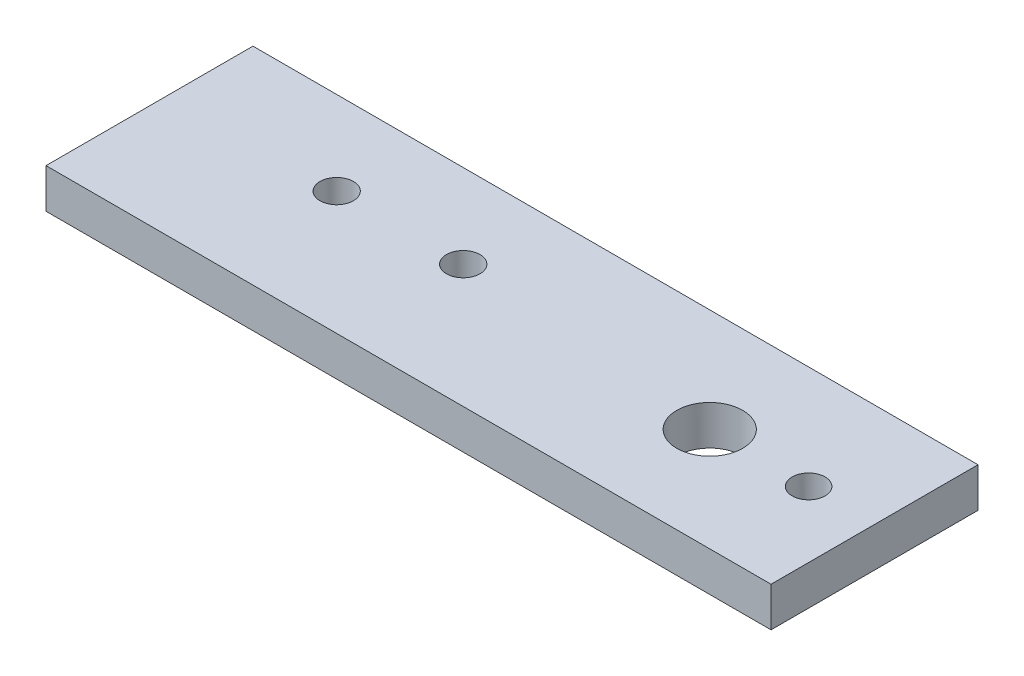
ISO-10303-21;
HEADER;
FILE_DESCRIPTION(('STEP AP214'),'2;1');
FILE_NAME('part.step','',(''),(''),'','','');
FILE_SCHEMA(('AUTOMOTIVE_DESIGN { 1 0 10303 214 1 1 1 1 }'));
ENDSEC;
DATA;
#1=APPLICATION_CONTEXT('core data for automotive mechanical design processes');
#2=APPLICATION_PROTOCOL_DEFINITION('international standard','automotive_design',2000,#1);
#3=PRODUCT_CONTEXT('',#1,'mechanical');
#4=PRODUCT('Part','Part','',(#3));
#5=PRODUCT_RELATED_PRODUCT_CATEGORY('part','',(#4));
#6=PRODUCT_DEFINITION_FORMATION('','',#4);
#7=PRODUCT_DEFINITION_CONTEXT('part definition',#1,'design');
#8=PRODUCT_DEFINITION('design','',#6,#7);
#9=PRODUCT_DEFINITION_SHAPE('','',#8);
#10=(LENGTH_UNIT() NAMED_UNIT(*) SI_UNIT(.MILLI.,.METRE.));
#11=(NAMED_UNIT(*) PLANE_ANGLE_UNIT() SI_UNIT($,.RADIAN.));
#12=(NAMED_UNIT(*) SI_UNIT($,.STERADIAN.) SOLID_ANGLE_UNIT());
#13=UNCERTAINTY_MEASURE_WITH_UNIT(LENGTH_MEASURE(1.E-05),#10,'distance_accuracy_value','');
#14=(GEOMETRIC_REPRESENTATION_CONTEXT(3) GLOBAL_UNCERTAINTY_ASSIGNED_CONTEXT((#13)) GLOBAL_UNIT_ASSIGNED_CONTEXT((#10,
#11,#12)) REPRESENTATION_CONTEXT('',''));
#15=CARTESIAN_POINT('',(0.,0.,0.));
#16=DIRECTION('',(0.,0.,1.));
#17=DIRECTION('',(1.,0.,0.));
#18=AXIS2_PLACEMENT_3D('',#15,#16,#17);
#19=CARTESIAN_POINT('',(55.,6.,15.7));
#20=DIRECTION('',(-1.,0.,0.));
#21=DIRECTION('',(0.,0.,1.));
#22=AXIS2_PLACEMENT_3D('',#19,#20,#21);
#23=PLANE('',#22);
#24=DIRECTION('',(0.,0.,-1.));
#25=VECTOR('',#24,1.);
#26=CARTESIAN_POINT('',(55.,0.,15.7));
#27=LINE('',#26,#25);
#28=CARTESIAN_POINT('',(55.,0.,15.7));
#29=VERTEX_POINT('',#28);
#30=CARTESIAN_POINT('',(55.,0.,-15.7));
#31=VERTEX_POINT('',#30);
#32=EDGE_CURVE('E105',#29,#31,#27,.T.);
#33=ORIENTED_EDGE('',*,*,#32,.T.);
#34=DIRECTION('',(0.,-1.,0.));
#35=VECTOR('',#34,1.);
#36=CARTESIAN_POINT('',(55.,6.,-15.7));
#37=LINE('',#36,#35);
#38=CARTESIAN_POINT('',(55.,6.,-15.7));
#39=VERTEX_POINT('',#38);
#40=EDGE_CURVE('E11',#39,#31,#37,.T.);
#41=ORIENTED_EDGE('',*,*,#40,.F.);
#42=DIRECTION('',(0.,0.,-1.));
#43=VECTOR('',#42,1.);
#44=CARTESIAN_POINT('',(55.,6.,15.7));
#45=LINE('',#44,#43);
#46=CARTESIAN_POINT('',(55.,6.,15.7));
#47=VERTEX_POINT('',#46);
#48=EDGE_CURVE('E93',#47,#39,#45,.T.);
#49=ORIENTED_EDGE('',*,*,#48,.F.);
#50=DIRECTION('',(0.,-1.,0.));
#51=VECTOR('',#50,1.);
#52=CARTESIAN_POINT('',(55.,6.,15.7));
#53=LINE('',#52,#51);
#54=EDGE_CURVE('E101',#47,#29,#53,.T.);
#55=ORIENTED_EDGE('',*,*,#54,.T.);
#56=EDGE_LOOP('',(#33,#41,#49,#55));
#57=FACE_BOUND('',#56,.T.);
#58=ADVANCED_FACE('F42',(#57),#23,.F.);
#59=CARTESIAN_POINT('',(-55.,6.,-15.7));
#60=DIRECTION('',(0.,0.,1.));
#61=DIRECTION('',(1.,0.,0.));
#62=AXIS2_PLACEMENT_3D('',#59,#60,#61);
#63=PLANE('',#62);
#64=DIRECTION('',(-1.,0.,0.));
#65=VECTOR('',#64,1.);
#66=CARTESIAN_POINT('',(-55.,0.,-15.7));
#67=LINE('',#66,#65);
#68=CARTESIAN_POINT('',(-55.,0.,-15.7));
#69=VERTEX_POINT('',#68);
#70=EDGE_CURVE('E97',#31,#69,#67,.T.);
#71=ORIENTED_EDGE('',*,*,#70,.T.);
#72=DIRECTION('',(0.,-1.,0.));
#73=VECTOR('',#72,1.);
#74=CARTESIAN_POINT('',(-55.,6.,-15.7));
#75=LINE('',#74,#73);
#76=CARTESIAN_POINT('',(-55.,6.,-15.7));
#77=VERTEX_POINT('',#76);
#78=EDGE_CURVE('E50',#77,#69,#75,.T.);
#79=ORIENTED_EDGE('',*,*,#78,.F.);
#80=DIRECTION('',(-1.,0.,0.));
#81=VECTOR('',#80,1.);
#82=CARTESIAN_POINT('',(-55.,6.,-15.7));
#83=LINE('',#82,#81);
#84=EDGE_CURVE('E88',#39,#77,#83,.T.);
#85=ORIENTED_EDGE('',*,*,#84,.F.);
#86=ORIENTED_EDGE('',*,*,#40,.T.);
#87=EDGE_LOOP('',(#71,#79,#85,#86));
#88=FACE_BOUND('',#87,.T.);
#89=ADVANCED_FACE('F96',(#88),#63,.F.);
#90=CARTESIAN_POINT('',(-55.,6.,15.7));
#91=DIRECTION('',(1.,0.,0.));
#92=DIRECTION('',(0.,0.,-1.));
#93=AXIS2_PLACEMENT_3D('',#90,#91,#92);
#94=PLANE('',#93);
#95=DIRECTION('',(0.,0.,1.));
#96=VECTOR('',#95,1.);
#97=CARTESIAN_POINT('',(-55.,0.,15.7));
#98=LINE('',#97,#96);
#99=CARTESIAN_POINT('',(-55.,0.,15.7));
#100=VERTEX_POINT('',#99);
#101=EDGE_CURVE('E75',#69,#100,#98,.T.);
#102=ORIENTED_EDGE('',*,*,#101,.T.);
#103=DIRECTION('',(0.,-1.,0.));
#104=VECTOR('',#103,1.);
#105=CARTESIAN_POINT('',(-55.,6.,15.7));
#106=LINE('',#105,#104);
#107=CARTESIAN_POINT('',(-55.,6.,15.7));
#108=VERTEX_POINT('',#107);
#109=EDGE_CURVE('E98',#108,#100,#106,.T.);
#110=ORIENTED_EDGE('',*,*,#109,.F.);
#111=DIRECTION('',(0.,0.,1.));
#112=VECTOR('',#111,1.);
#113=CARTESIAN_POINT('',(-55.,6.,15.7));
#114=LINE('',#113,#112);
#115=EDGE_CURVE('E91',#77,#108,#114,.T.);
#116=ORIENTED_EDGE('',*,*,#115,.F.);
#117=ORIENTED_EDGE('',*,*,#78,.T.);
#118=EDGE_LOOP('',(#102,#110,#116,#117));
#119=FACE_BOUND('',#118,.T.);
#120=ADVANCED_FACE('F99',(#119),#94,.F.);
#121=CARTESIAN_POINT('',(-55.,6.,15.7));
#122=DIRECTION('',(0.,0.,-1.));
#123=DIRECTION('',(-1.,0.,0.));
#124=AXIS2_PLACEMENT_3D('',#121,#122,#123);
#125=PLANE('',#124);
#126=DIRECTION('',(1.,0.,0.));
#127=VECTOR('',#126,1.);
#128=CARTESIAN_POINT('',(-55.,0.,15.7));
#129=LINE('',#128,#127);
#130=EDGE_CURVE('E81',#100,#29,#129,.T.);
#131=ORIENTED_EDGE('',*,*,#130,.T.);
#132=ORIENTED_EDGE('',*,*,#54,.F.);
#133=DIRECTION('',(1.,0.,0.));
#134=VECTOR('',#133,1.);
#135=CARTESIAN_POINT('',(-55.,6.,15.7));
#136=LINE('',#135,#134);
#137=EDGE_CURVE('E58',#108,#47,#136,.T.);
#138=ORIENTED_EDGE('',*,*,#137,.F.);
#139=ORIENTED_EDGE('',*,*,#109,.T.);
#140=EDGE_LOOP('',(#131,#132,#138,#139));
#141=FACE_BOUND('',#140,.T.);
#142=ADVANCED_FACE('F113',(#141),#125,.F.);
#143=CARTESIAN_POINT('',(0.,6.,0.));
#144=DIRECTION('',(0.,-1.,0.));
#145=DIRECTION('',(0.,0.,-1.));
#146=AXIS2_PLACEMENT_3D('',#143,#144,#145);
#147=PLANE('',#146);
#148=CARTESIAN_POINT('',(45.,6.,0.));
#149=DIRECTION('',(0.,-1.,0.));
#150=DIRECTION('',(0.,0.,-1.));
#151=AXIS2_PLACEMENT_3D('',#148,#149,#150);
#152=CIRCLE('',#151,2.5);
#153=CARTESIAN_POINT('',(45.,6.,-2.5));
#154=VERTEX_POINT('',#153);
#155=EDGE_CURVE('E108',#154,#154,#152,.T.);
#156=ORIENTED_EDGE('',*,*,#155,.T.);
#157=EDGE_LOOP('',(#156));
#158=FACE_BOUND('',#157,.T.);
#159=CARTESIAN_POINT('',(30.,6.,0.));
#160=DIRECTION('',(0.,-1.,0.));
#161=DIRECTION('',(0.,0.,-1.));
#162=AXIS2_PLACEMENT_3D('',#159,#160,#161);
#163=CIRCLE('',#162,4.99999999999999);
#164=CARTESIAN_POINT('',(30.,6.,-4.99999999999999));
#165=VERTEX_POINT('',#164);
#166=EDGE_CURVE('E121',#165,#165,#163,.T.);
#167=ORIENTED_EDGE('',*,*,#166,.T.);
#168=EDGE_LOOP('',(#167));
#169=FACE_BOUND('',#168,.T.);
#170=CARTESIAN_POINT('',(-29.6,6.,-3.));
#171=DIRECTION('',(0.,-1.,0.));
#172=DIRECTION('',(0.,0.,-1.));
#173=AXIS2_PLACEMENT_3D('',#170,#171,#172);
#174=CIRCLE('',#173,2.54);
#175=CARTESIAN_POINT('',(-29.6,6.,-5.54));
#176=VERTEX_POINT('',#175);
#177=EDGE_CURVE('E124',#176,#176,#174,.T.);
#178=ORIENTED_EDGE('',*,*,#177,.T.);
#179=EDGE_LOOP('',(#178));
#180=FACE_BOUND('',#179,.T.);
#181=CARTESIAN_POINT('',(-10.4,6.,-2.99999999999999));
#182=DIRECTION('',(0.,-1.,0.));
#183=DIRECTION('',(0.,0.,-1.));
#184=AXIS2_PLACEMENT_3D('',#181,#182,#183);
#185=CIRCLE('',#184,2.54);
#186=CARTESIAN_POINT('',(-10.4,6.,-5.54));
#187=VERTEX_POINT('',#186);
#188=EDGE_CURVE('E127',#187,#187,#185,.T.);
#189=ORIENTED_EDGE('',*,*,#188,.T.);
#190=EDGE_LOOP('',(#189));
#191=FACE_BOUND('',#190,.T.);
#192=ORIENTED_EDGE('',*,*,#48,.T.);
#193=ORIENTED_EDGE('',*,*,#84,.T.);
#194=ORIENTED_EDGE('',*,*,#115,.T.);
#195=ORIENTED_EDGE('',*,*,#137,.T.);
#196=EDGE_LOOP('',(#192,#193,#194,#195));
#197=FACE_BOUND('',#196,.T.);
#198=ADVANCED_FACE('F89',(#158,#169,#180,#191,#197),#147,.F.);
#199=CARTESIAN_POINT('',(0.,0.,0.));
#200=DIRECTION('',(0.,-1.,0.));
#201=DIRECTION('',(0.,0.,-1.));
#202=AXIS2_PLACEMENT_3D('',#199,#200,#201);
#203=PLANE('',#202);
#204=CARTESIAN_POINT('',(45.,0.,0.));
#205=DIRECTION('',(0.,1.,0.));
#206=DIRECTION('',(0.,0.,1.));
#207=AXIS2_PLACEMENT_3D('',#204,#205,#206);
#208=CIRCLE('',#207,2.5);
#209=CARTESIAN_POINT('',(45.,0.,2.5));
#210=VERTEX_POINT('',#209);
#211=EDGE_CURVE('E134',#210,#210,#208,.T.);
#212=ORIENTED_EDGE('',*,*,#211,.T.);
#213=EDGE_LOOP('',(#212));
#214=FACE_BOUND('',#213,.T.);
#215=CARTESIAN_POINT('',(30.,0.,0.));
#216=DIRECTION('',(0.,1.,0.));
#217=DIRECTION('',(0.,0.,1.));
#218=AXIS2_PLACEMENT_3D('',#215,#216,#217);
#219=CIRCLE('',#218,4.99999999999999);
#220=CARTESIAN_POINT('',(30.,0.,4.99999999999999));
#221=VERTEX_POINT('',#220);
#222=EDGE_CURVE('E137',#221,#221,#219,.T.);
#223=ORIENTED_EDGE('',*,*,#222,.T.);
#224=EDGE_LOOP('',(#223));
#225=FACE_BOUND('',#224,.T.);
#226=CARTESIAN_POINT('',(-29.6,0.,-3.));
#227=DIRECTION('',(0.,1.,0.));
#228=DIRECTION('',(0.,0.,1.));
#229=AXIS2_PLACEMENT_3D('',#226,#227,#228);
#230=CIRCLE('',#229,2.54);
#231=CARTESIAN_POINT('',(-29.6,0.,-0.459999999999997));
#232=VERTEX_POINT('',#231);
#233=EDGE_CURVE('E133',#232,#232,#230,.T.);
#234=ORIENTED_EDGE('',*,*,#233,.T.);
#235=EDGE_LOOP('',(#234));
#236=FACE_BOUND('',#235,.T.);
#237=CARTESIAN_POINT('',(-10.4,0.,-2.99999999999999));
#238=DIRECTION('',(0.,1.,0.));
#239=DIRECTION('',(0.,0.,1.));
#240=AXIS2_PLACEMENT_3D('',#237,#238,#239);
#241=CIRCLE('',#240,2.54);
#242=CARTESIAN_POINT('',(-10.4,0.,-0.459999999999994));
#243=VERTEX_POINT('',#242);
#244=EDGE_CURVE('E130',#243,#243,#241,.T.);
#245=ORIENTED_EDGE('',*,*,#244,.T.);
#246=EDGE_LOOP('',(#245));
#247=FACE_BOUND('',#246,.T.);
#248=ORIENTED_EDGE('',*,*,#32,.F.);
#249=ORIENTED_EDGE('',*,*,#130,.F.);
#250=ORIENTED_EDGE('',*,*,#101,.F.);
#251=ORIENTED_EDGE('',*,*,#70,.F.);
#252=EDGE_LOOP('',(#248,#249,#250,#251));
#253=FACE_BOUND('',#252,.T.);
#254=ADVANCED_FACE('F116',(#214,#225,#236,#247,#253),#203,.T.);
#255=CARTESIAN_POINT('',(-10.4,0.,-2.99999999999999));
#256=DIRECTION('',(0.,1.,0.));
#257=DIRECTION('',(0.,0.,1.));
#258=AXIS2_PLACEMENT_3D('',#255,#256,#257);
#259=CYLINDRICAL_SURFACE('',#258,2.54);
#260=ORIENTED_EDGE('',*,*,#244,.F.);
#261=EDGE_LOOP('',(#260));
#262=FACE_BOUND('',#261,.T.);
#263=ORIENTED_EDGE('',*,*,#188,.F.);
#264=EDGE_LOOP('',(#263));
#265=FACE_BOUND('',#264,.T.);
#266=ADVANCED_FACE('F149',(#262,#265),#259,.F.);
#267=CARTESIAN_POINT('',(-29.6,0.,-3.));
#268=DIRECTION('',(0.,1.,0.));
#269=DIRECTION('',(0.,0.,1.));
#270=AXIS2_PLACEMENT_3D('',#267,#268,#269);
#271=CYLINDRICAL_SURFACE('',#270,2.54);
#272=ORIENTED_EDGE('',*,*,#233,.F.);
#273=EDGE_LOOP('',(#272));
#274=FACE_BOUND('',#273,.T.);
#275=ORIENTED_EDGE('',*,*,#177,.F.);
#276=EDGE_LOOP('',(#275));
#277=FACE_BOUND('',#276,.T.);
#278=ADVANCED_FACE('F145',(#274,#277),#271,.F.);
#279=CARTESIAN_POINT('',(30.,0.,0.));
#280=DIRECTION('',(0.,1.,0.));
#281=DIRECTION('',(0.,0.,1.));
#282=AXIS2_PLACEMENT_3D('',#279,#280,#281);
#283=CYLINDRICAL_SURFACE('',#282,4.99999999999999);
#284=ORIENTED_EDGE('',*,*,#222,.F.);
#285=EDGE_LOOP('',(#284));
#286=FACE_BOUND('',#285,.T.);
#287=ORIENTED_EDGE('',*,*,#166,.F.);
#288=EDGE_LOOP('',(#287));
#289=FACE_BOUND('',#288,.T.);
#290=ADVANCED_FACE('F148',(#286,#289),#283,.F.);
#291=CARTESIAN_POINT('',(45.,0.,0.));
#292=DIRECTION('',(0.,1.,0.));
#293=DIRECTION('',(0.,0.,1.));
#294=AXIS2_PLACEMENT_3D('',#291,#292,#293);
#295=CYLINDRICAL_SURFACE('',#294,2.5);
#296=ORIENTED_EDGE('',*,*,#211,.F.);
#297=EDGE_LOOP('',(#296));
#298=FACE_BOUND('',#297,.T.);
#299=ORIENTED_EDGE('',*,*,#155,.F.);
#300=EDGE_LOOP('',(#299));
#301=FACE_BOUND('',#300,.T.);
#302=ADVANCED_FACE('F213',(#298,#301),#295,.F.);
#303=CLOSED_SHELL('',(#58,#89,#120,#142,#198,#254,#266,#278,#290,#302));
#304=MANIFOLD_SOLID_BREP('B2',#303);
#305=ADVANCED_BREP_SHAPE_REPRESENTATION('',(#18,#304),#14);
#306=SHAPE_DEFINITION_REPRESENTATION(#9,#305);
ENDSEC;
END-ISO-10303-21;
